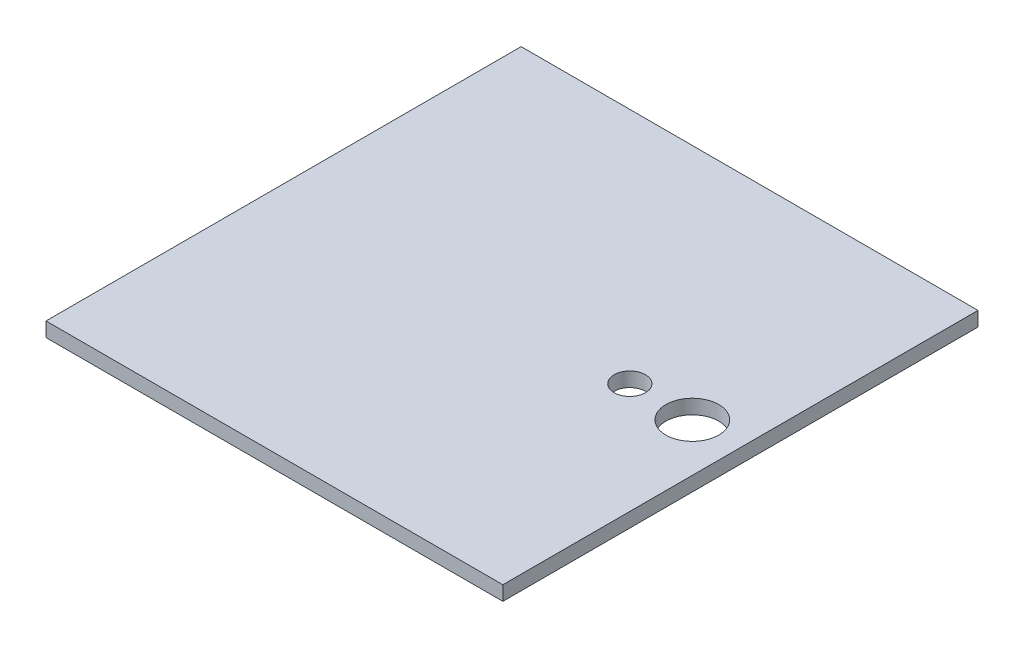
ISO-10303-21;
HEADER;
FILE_DESCRIPTION(('STEP AP214'),'2;1');
FILE_NAME('part.step','',(''),(''),'','','');
FILE_SCHEMA(('AUTOMOTIVE_DESIGN { 1 0 10303 214 1 1 1 1 }'));
ENDSEC;
DATA;
#1=APPLICATION_CONTEXT('core data for automotive mechanical design processes');
#2=APPLICATION_PROTOCOL_DEFINITION('international standard','automotive_design',2000,#1);
#3=PRODUCT_CONTEXT('',#1,'mechanical');
#4=PRODUCT('Part','Part','',(#3));
#5=PRODUCT_RELATED_PRODUCT_CATEGORY('part','',(#4));
#6=PRODUCT_DEFINITION_FORMATION('','',#4);
#7=PRODUCT_DEFINITION_CONTEXT('part definition',#1,'design');
#8=PRODUCT_DEFINITION('design','',#6,#7);
#9=PRODUCT_DEFINITION_SHAPE('','',#8);
#10=(LENGTH_UNIT() NAMED_UNIT(*) SI_UNIT(.MILLI.,.METRE.));
#11=(NAMED_UNIT(*) PLANE_ANGLE_UNIT() SI_UNIT($,.RADIAN.));
#12=(NAMED_UNIT(*) SI_UNIT($,.STERADIAN.) SOLID_ANGLE_UNIT());
#13=UNCERTAINTY_MEASURE_WITH_UNIT(LENGTH_MEASURE(1.E-05),#10,'distance_accuracy_value','');
#14=(GEOMETRIC_REPRESENTATION_CONTEXT(3) GLOBAL_UNCERTAINTY_ASSIGNED_CONTEXT((#13)) GLOBAL_UNIT_ASSIGNED_CONTEXT((#10,
#11,#12)) REPRESENTATION_CONTEXT('',''));
#15=CARTESIAN_POINT('',(0.,0.,0.));
#16=DIRECTION('',(0.,0.,1.));
#17=DIRECTION('',(1.,0.,0.));
#18=AXIS2_PLACEMENT_3D('',#15,#16,#17);
#19=CARTESIAN_POINT('',(0.,3.,0.));
#20=DIRECTION('',(0.,1.,0.));
#21=DIRECTION('',(0.,0.,1.));
#22=AXIS2_PLACEMENT_3D('',#19,#20,#21);
#23=PLANE('',#22);
#24=CARTESIAN_POINT('',(-16.2815420560747,3.,28.7019859813084));
#25=DIRECTION('',(0.,1.,0.));
#26=DIRECTION('',(0.,0.,1.));
#27=AXIS2_PLACEMENT_3D('',#24,#25,#26);
#28=CIRCLE('',#27,5.5);
#29=CARTESIAN_POINT('',(-16.2815420560747,3.,34.2019859813084));
#30=VERTEX_POINT('',#29);
#31=EDGE_CURVE('E100',#30,#30,#28,.T.);
#32=ORIENTED_EDGE('',*,*,#31,.F.);
#33=EDGE_LOOP('',(#32));
#34=FACE_BOUND('',#33,.T.);
#35=DIRECTION('',(0.,0.,1.));
#36=VECTOR('',#35,1.);
#37=CARTESIAN_POINT('',(-101.281542056075,3.,-20.6980140186916));
#38=LINE('',#37,#36);
#39=CARTESIAN_POINT('',(-101.281542056075,3.,-20.6980140186916));
#40=VERTEX_POINT('',#39);
#41=CARTESIAN_POINT('',(-101.281542056075,3.,78.1019859813084));
#42=VERTEX_POINT('',#41);
#43=EDGE_CURVE('E85',#40,#42,#38,.T.);
#44=ORIENTED_EDGE('',*,*,#43,.T.);
#45=DIRECTION('',(1.,0.,0.));
#46=VECTOR('',#45,1.);
#47=CARTESIAN_POINT('',(-101.281542056075,3.,78.1019859813084));
#48=LINE('',#47,#46);
#49=CARTESIAN_POINT('',(-6.28154205607472,3.,78.1019859813084));
#50=VERTEX_POINT('',#49);
#51=EDGE_CURVE('E80',#42,#50,#48,.T.);
#52=ORIENTED_EDGE('',*,*,#51,.T.);
#53=DIRECTION('',(0.,0.,-1.));
#54=VECTOR('',#53,1.);
#55=CARTESIAN_POINT('',(-6.28154205607473,3.,-20.6980140186916));
#56=LINE('',#55,#54);
#57=CARTESIAN_POINT('',(-6.28154205607473,3.,-20.6980140186916));
#58=VERTEX_POINT('',#57);
#59=EDGE_CURVE('E83',#50,#58,#56,.T.);
#60=ORIENTED_EDGE('',*,*,#59,.T.);
#61=DIRECTION('',(-1.,0.,0.));
#62=VECTOR('',#61,1.);
#63=CARTESIAN_POINT('',(-101.281542056075,3.,-20.6980140186916));
#64=LINE('',#63,#62);
#65=EDGE_CURVE('E50',#58,#40,#64,.T.);
#66=ORIENTED_EDGE('',*,*,#65,.T.);
#67=EDGE_LOOP('',(#44,#52,#60,#66));
#68=FACE_BOUND('',#67,.T.);
#69=CARTESIAN_POINT('',(-29.2815420560747,3.,28.7019859813084));
#70=DIRECTION('',(0.,1.,0.));
#71=DIRECTION('',(0.,0.,1.));
#72=AXIS2_PLACEMENT_3D('',#69,#70,#71);
#73=CIRCLE('',#72,3.25);
#74=CARTESIAN_POINT('',(-29.2815420560747,3.,31.9519859813084));
#75=VERTEX_POINT('',#74);
#76=EDGE_CURVE('E115',#75,#75,#73,.T.);
#77=ORIENTED_EDGE('',*,*,#76,.F.);
#78=EDGE_LOOP('',(#77));
#79=FACE_BOUND('',#78,.T.);
#80=ADVANCED_FACE('F33',(#34,#68,#79),#23,.T.);
#81=CARTESIAN_POINT('',(0.,0.,0.));
#82=DIRECTION('',(0.,1.,0.));
#83=DIRECTION('',(0.,0.,1.));
#84=AXIS2_PLACEMENT_3D('',#81,#82,#83);
#85=PLANE('',#84);
#86=DIRECTION('',(0.,0.,1.));
#87=VECTOR('',#86,1.);
#88=CARTESIAN_POINT('',(-101.281542056075,0.,-20.6980140186916));
#89=LINE('',#88,#87);
#90=CARTESIAN_POINT('',(-101.281542056075,0.,-20.6980140186916));
#91=VERTEX_POINT('',#90);
#92=CARTESIAN_POINT('',(-101.281542056075,0.,78.1019859813084));
#93=VERTEX_POINT('',#92);
#94=EDGE_CURVE('E97',#91,#93,#89,.T.);
#95=ORIENTED_EDGE('',*,*,#94,.F.);
#96=DIRECTION('',(-1.,0.,0.));
#97=VECTOR('',#96,1.);
#98=CARTESIAN_POINT('',(-101.281542056075,0.,-20.6980140186916));
#99=LINE('',#98,#97);
#100=CARTESIAN_POINT('',(-6.28154205607473,0.,-20.6980140186916));
#101=VERTEX_POINT('',#100);
#102=EDGE_CURVE('E73',#101,#91,#99,.T.);
#103=ORIENTED_EDGE('',*,*,#102,.F.);
#104=DIRECTION('',(0.,0.,-1.));
#105=VECTOR('',#104,1.);
#106=CARTESIAN_POINT('',(-6.28154205607473,0.,-20.6980140186916));
#107=LINE('',#106,#105);
#108=CARTESIAN_POINT('',(-6.28154205607472,0.,78.1019859813084));
#109=VERTEX_POINT('',#108);
#110=EDGE_CURVE('E67',#109,#101,#107,.T.);
#111=ORIENTED_EDGE('',*,*,#110,.F.);
#112=DIRECTION('',(1.,0.,0.));
#113=VECTOR('',#112,1.);
#114=CARTESIAN_POINT('',(-101.281542056075,0.,78.1019859813084));
#115=LINE('',#114,#113);
#116=EDGE_CURVE('E89',#93,#109,#115,.T.);
#117=ORIENTED_EDGE('',*,*,#116,.F.);
#118=EDGE_LOOP('',(#95,#103,#111,#117));
#119=FACE_BOUND('',#118,.T.);
#120=CARTESIAN_POINT('',(-16.2815420560747,0.,28.7019859813084));
#121=DIRECTION('',(0.,1.,0.));
#122=DIRECTION('',(0.,0.,1.));
#123=AXIS2_PLACEMENT_3D('',#120,#121,#122);
#124=CIRCLE('',#123,5.5);
#125=CARTESIAN_POINT('',(-16.2815420560747,0.,34.2019859813084));
#126=VERTEX_POINT('',#125);
#127=EDGE_CURVE('E112',#126,#126,#124,.T.);
#128=ORIENTED_EDGE('',*,*,#127,.T.);
#129=EDGE_LOOP('',(#128));
#130=FACE_BOUND('',#129,.T.);
#131=CARTESIAN_POINT('',(-29.2815420560747,0.,28.7019859813084));
#132=DIRECTION('',(0.,1.,0.));
#133=DIRECTION('',(0.,0.,1.));
#134=AXIS2_PLACEMENT_3D('',#131,#132,#133);
#135=CIRCLE('',#134,3.25);
#136=CARTESIAN_POINT('',(-29.2815420560747,0.,31.9519859813084));
#137=VERTEX_POINT('',#136);
#138=EDGE_CURVE('E118',#137,#137,#135,.T.);
#139=ORIENTED_EDGE('',*,*,#138,.T.);
#140=EDGE_LOOP('',(#139));
#141=FACE_BOUND('',#140,.T.);
#142=ADVANCED_FACE('F108',(#119,#130,#141),#85,.F.);
#143=CARTESIAN_POINT('',(-101.281542056075,3.,-20.6980140186916));
#144=DIRECTION('',(1.,0.,0.));
#145=DIRECTION('',(0.,0.,-1.));
#146=AXIS2_PLACEMENT_3D('',#143,#144,#145);
#147=PLANE('',#146);
#148=ORIENTED_EDGE('',*,*,#94,.T.);
#149=DIRECTION('',(0.,-1.,0.));
#150=VECTOR('',#149,1.);
#151=CARTESIAN_POINT('',(-101.281542056075,3.,78.1019859813084));
#152=LINE('',#151,#150);
#153=EDGE_CURVE('E11',#42,#93,#152,.T.);
#154=ORIENTED_EDGE('',*,*,#153,.F.);
#155=ORIENTED_EDGE('',*,*,#43,.F.);
#156=DIRECTION('',(0.,-1.,0.));
#157=VECTOR('',#156,1.);
#158=CARTESIAN_POINT('',(-101.281542056075,3.,-20.6980140186916));
#159=LINE('',#158,#157);
#160=EDGE_CURVE('E93',#40,#91,#159,.T.);
#161=ORIENTED_EDGE('',*,*,#160,.T.);
#162=EDGE_LOOP('',(#148,#154,#155,#161));
#163=FACE_BOUND('',#162,.T.);
#164=ADVANCED_FACE('F35',(#163),#147,.F.);
#165=CARTESIAN_POINT('',(-101.281542056075,3.,78.1019859813084));
#166=DIRECTION('',(0.,0.,-1.));
#167=DIRECTION('',(-1.,0.,0.));
#168=AXIS2_PLACEMENT_3D('',#165,#166,#167);
#169=PLANE('',#168);
#170=ORIENTED_EDGE('',*,*,#116,.T.);
#171=DIRECTION('',(0.,-1.,0.));
#172=VECTOR('',#171,1.);
#173=CARTESIAN_POINT('',(-6.28154205607472,3.,78.1019859813084));
#174=LINE('',#173,#172);
#175=EDGE_CURVE('E42',#50,#109,#174,.T.);
#176=ORIENTED_EDGE('',*,*,#175,.F.);
#177=ORIENTED_EDGE('',*,*,#51,.F.);
#178=ORIENTED_EDGE('',*,*,#153,.T.);
#179=EDGE_LOOP('',(#170,#176,#177,#178));
#180=FACE_BOUND('',#179,.T.);
#181=ADVANCED_FACE('F88',(#180),#169,.F.);
#182=CARTESIAN_POINT('',(-6.28154205607473,3.,-20.6980140186916));
#183=DIRECTION('',(-1.,0.,0.));
#184=DIRECTION('',(0.,0.,1.));
#185=AXIS2_PLACEMENT_3D('',#182,#183,#184);
#186=PLANE('',#185);
#187=ORIENTED_EDGE('',*,*,#110,.T.);
#188=DIRECTION('',(0.,-1.,0.));
#189=VECTOR('',#188,1.);
#190=CARTESIAN_POINT('',(-6.28154205607473,3.,-20.6980140186916));
#191=LINE('',#190,#189);
#192=EDGE_CURVE('E90',#58,#101,#191,.T.);
#193=ORIENTED_EDGE('',*,*,#192,.F.);
#194=ORIENTED_EDGE('',*,*,#59,.F.);
#195=ORIENTED_EDGE('',*,*,#175,.T.);
#196=EDGE_LOOP('',(#187,#193,#194,#195));
#197=FACE_BOUND('',#196,.T.);
#198=ADVANCED_FACE('F91',(#197),#186,.F.);
#199=CARTESIAN_POINT('',(-101.281542056075,3.,-20.6980140186916));
#200=DIRECTION('',(0.,0.,1.));
#201=DIRECTION('',(1.,0.,0.));
#202=AXIS2_PLACEMENT_3D('',#199,#200,#201);
#203=PLANE('',#202);
#204=ORIENTED_EDGE('',*,*,#102,.T.);
#205=ORIENTED_EDGE('',*,*,#160,.F.);
#206=ORIENTED_EDGE('',*,*,#65,.F.);
#207=ORIENTED_EDGE('',*,*,#192,.T.);
#208=EDGE_LOOP('',(#204,#205,#206,#207));
#209=FACE_BOUND('',#208,.T.);
#210=ADVANCED_FACE('F105',(#209),#203,.F.);
#211=CARTESIAN_POINT('',(-16.2815420560747,3.,28.7019859813084));
#212=DIRECTION('',(0.,-1.,0.));
#213=DIRECTION('',(0.,0.,-1.));
#214=AXIS2_PLACEMENT_3D('',#211,#212,#213);
#215=CYLINDRICAL_SURFACE('',#214,5.5);
#216=ORIENTED_EDGE('',*,*,#31,.T.);
#217=EDGE_LOOP('',(#216));
#218=FACE_BOUND('',#217,.T.);
#219=ORIENTED_EDGE('',*,*,#127,.F.);
#220=EDGE_LOOP('',(#219));
#221=FACE_BOUND('',#220,.T.);
#222=ADVANCED_FACE('F135',(#218,#221),#215,.F.);
#223=CARTESIAN_POINT('',(-29.2815420560747,3.,28.7019859813084));
#224=DIRECTION('',(0.,-1.,0.));
#225=DIRECTION('',(0.,0.,-1.));
#226=AXIS2_PLACEMENT_3D('',#223,#224,#225);
#227=CYLINDRICAL_SURFACE('',#226,3.25);
#228=ORIENTED_EDGE('',*,*,#76,.T.);
#229=EDGE_LOOP('',(#228));
#230=FACE_BOUND('',#229,.T.);
#231=ORIENTED_EDGE('',*,*,#138,.F.);
#232=EDGE_LOOP('',(#231));
#233=FACE_BOUND('',#232,.T.);
#234=ADVANCED_FACE('F124',(#230,#233),#227,.F.);
#235=CLOSED_SHELL('',(#80,#142,#164,#181,#198,#210,#222,#234));
#236=MANIFOLD_SOLID_BREP('B2',#235);
#237=ADVANCED_BREP_SHAPE_REPRESENTATION('',(#18,#236),#14);
#238=SHAPE_DEFINITION_REPRESENTATION(#9,#237);
ENDSEC;
END-ISO-10303-21;
